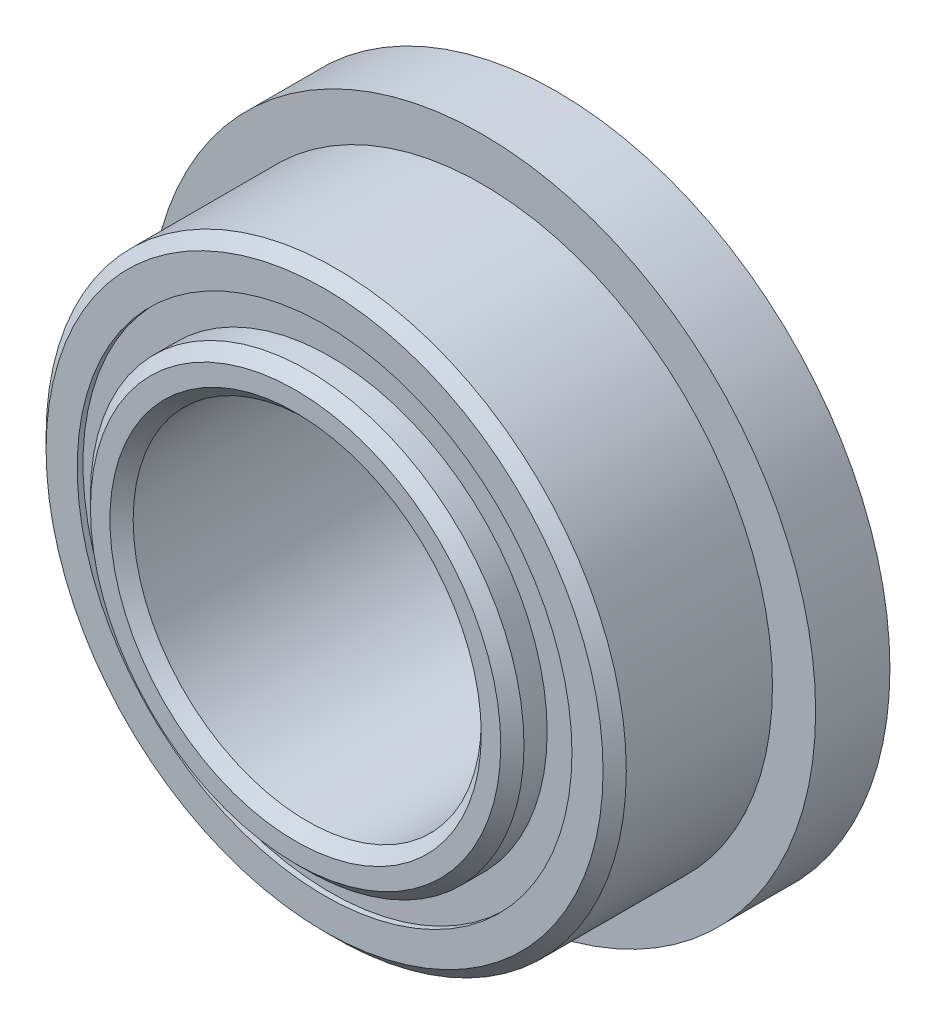
ISO-10303-21;
HEADER;
FILE_DESCRIPTION(('STEP AP214'),'2;1');
FILE_NAME('part.step','',(''),(''),'','','');
FILE_SCHEMA(('AUTOMOTIVE_DESIGN { 1 0 10303 214 1 1 1 1 }'));
ENDSEC;
DATA;
#1=APPLICATION_CONTEXT('core data for automotive mechanical design processes');
#2=APPLICATION_PROTOCOL_DEFINITION('international standard','automotive_design',2000,#1);
#3=PRODUCT_CONTEXT('',#1,'mechanical');
#4=PRODUCT('Part','Part','',(#3));
#5=PRODUCT_RELATED_PRODUCT_CATEGORY('part','',(#4));
#6=PRODUCT_DEFINITION_FORMATION('','',#4);
#7=PRODUCT_DEFINITION_CONTEXT('part definition',#1,'design');
#8=PRODUCT_DEFINITION('design','',#6,#7);
#9=PRODUCT_DEFINITION_SHAPE('','',#8);
#10=(LENGTH_UNIT() NAMED_UNIT(*) SI_UNIT(.MILLI.,.METRE.));
#11=(NAMED_UNIT(*) PLANE_ANGLE_UNIT() SI_UNIT($,.RADIAN.));
#12=(NAMED_UNIT(*) SI_UNIT($,.STERADIAN.) SOLID_ANGLE_UNIT());
#13=UNCERTAINTY_MEASURE_WITH_UNIT(LENGTH_MEASURE(1.E-05),#10,'distance_accuracy_value','');
#14=(GEOMETRIC_REPRESENTATION_CONTEXT(3) GLOBAL_UNCERTAINTY_ASSIGNED_CONTEXT((#13)) GLOBAL_UNIT_ASSIGNED_CONTEXT((#10,
#11,#12)) REPRESENTATION_CONTEXT('',''));
#15=CARTESIAN_POINT('',(0.,0.,0.));
#16=DIRECTION('',(0.,0.,1.));
#17=DIRECTION('',(1.,0.,0.));
#18=AXIS2_PLACEMENT_3D('',#15,#16,#17);
#19=CARTESIAN_POINT('',(0.,3.38434065934066,-1.508125));
#20=DIRECTION('',(0.,0.,1.));
#21=DIRECTION('',(1.,0.,0.));
#22=AXIS2_PLACEMENT_3D('',#19,#20,#21);
#23=PLANE('',#22);
#24=CARTESIAN_POINT('',(0.,0.,-1.508125));
#25=DIRECTION('',(0.,0.,1.));
#26=DIRECTION('',(1.,0.,0.));
#27=AXIS2_PLACEMENT_3D('',#24,#25,#26);
#28=CIRCLE('',#27,3.38434065934066);
#29=CARTESIAN_POINT('',(3.38434065934066,0.,-1.508125));
#30=VERTEX_POINT('',#29);
#31=EDGE_CURVE('E55',#30,#30,#28,.T.);
#32=ORIENTED_EDGE('',*,*,#31,.F.);
#33=EDGE_LOOP('',(#32));
#34=FACE_BOUND('',#33,.T.);
#35=CARTESIAN_POINT('',(0.,0.,-1.508125));
#36=DIRECTION('',(0.,0.,1.));
#37=DIRECTION('',(1.,0.,0.));
#38=AXIS2_PLACEMENT_3D('',#35,#36,#37);
#39=CIRCLE('',#38,2.96565934065934);
#40=CARTESIAN_POINT('',(2.96565934065934,0.,-1.508125));
#41=VERTEX_POINT('',#40);
#42=EDGE_CURVE('E11',#41,#41,#39,.T.);
#43=ORIENTED_EDGE('',*,*,#42,.T.);
#44=EDGE_LOOP('',(#43));
#45=FACE_BOUND('',#44,.T.);
#46=ADVANCED_FACE('F41',(#34,#45),#23,.F.);
#47=CARTESIAN_POINT('',(0.,0.,1.5875));
#48=DIRECTION('',(0.,0.,1.));
#49=DIRECTION('',(1.,0.,0.));
#50=AXIS2_PLACEMENT_3D('',#47,#48,#49);
#51=CYLINDRICAL_SURFACE('',#50,2.96565934065934);
#52=ORIENTED_EDGE('',*,*,#42,.F.);
#53=EDGE_LOOP('',(#52));
#54=FACE_BOUND('',#53,.T.);
#55=CARTESIAN_POINT('',(0.,0.,-0.735956624828183));
#56=DIRECTION('',(0.,0.,1.));
#57=DIRECTION('',(1.,0.,0.));
#58=AXIS2_PLACEMENT_3D('',#55,#56,#57);
#59=CIRCLE('',#58,2.96565934065934);
#60=CARTESIAN_POINT('',(2.96565934065934,0.,-0.735956624828183));
#61=VERTEX_POINT('',#60);
#62=EDGE_CURVE('E47',#61,#61,#59,.T.);
#63=ORIENTED_EDGE('',*,*,#62,.T.);
#64=EDGE_LOOP('',(#63));
#65=FACE_BOUND('',#64,.T.);
#66=ADVANCED_FACE('F64',(#54,#65),#51,.F.);
#67=CARTESIAN_POINT('',(0.,3.38434065934066,-0.735956624828183));
#68=DIRECTION('',(0.,0.,-1.));
#69=DIRECTION('',(-1.,0.,0.));
#70=AXIS2_PLACEMENT_3D('',#67,#68,#69);
#71=PLANE('',#70);
#72=ORIENTED_EDGE('',*,*,#62,.F.);
#73=EDGE_LOOP('',(#72));
#74=FACE_BOUND('',#73,.T.);
#75=CARTESIAN_POINT('',(0.,0.,-0.735956624828183));
#76=DIRECTION('',(0.,0.,1.));
#77=DIRECTION('',(1.,0.,0.));
#78=AXIS2_PLACEMENT_3D('',#75,#76,#77);
#79=CIRCLE('',#78,3.38434065934066);
#80=CARTESIAN_POINT('',(3.38434065934066,0.,-0.735956624828183));
#81=VERTEX_POINT('',#80);
#82=EDGE_CURVE('E51',#81,#81,#79,.T.);
#83=ORIENTED_EDGE('',*,*,#82,.T.);
#84=EDGE_LOOP('',(#83));
#85=FACE_BOUND('',#84,.T.);
#86=ADVANCED_FACE('F68',(#74,#85),#71,.F.);
#87=CARTESIAN_POINT('',(0.,0.,1.5875));
#88=DIRECTION('',(0.,0.,1.));
#89=DIRECTION('',(1.,0.,0.));
#90=AXIS2_PLACEMENT_3D('',#87,#88,#89);
#91=CYLINDRICAL_SURFACE('',#90,3.38434065934066);
#92=ORIENTED_EDGE('',*,*,#82,.F.);
#93=EDGE_LOOP('',(#92));
#94=FACE_BOUND('',#93,.T.);
#95=ORIENTED_EDGE('',*,*,#31,.T.);
#96=EDGE_LOOP('',(#95));
#97=FACE_BOUND('',#96,.T.);
#98=ADVANCED_FACE('F61',(#94,#97),#91,.T.);
#99=CLOSED_SHELL('',(#46,#66,#86,#98));
#100=MANIFOLD_SOLID_BREP('B2',#99);
#101=CARTESIAN_POINT('',(0.,3.38434065934066,1.508125));
#102=DIRECTION('',(0.,0.,-1.));
#103=DIRECTION('',(-1.,0.,0.));
#104=AXIS2_PLACEMENT_3D('',#101,#102,#103);
#105=PLANE('',#104);
#106=CARTESIAN_POINT('',(0.,0.,1.508125));
#107=DIRECTION('',(0.,0.,1.));
#108=DIRECTION('',(1.,0.,0.));
#109=AXIS2_PLACEMENT_3D('',#106,#107,#108);
#110=CIRCLE('',#109,2.96565934065934);
#111=CARTESIAN_POINT('',(2.96565934065934,0.,1.508125));
#112=VERTEX_POINT('',#111);
#113=EDGE_CURVE('E40',#112,#112,#110,.T.);
#114=ORIENTED_EDGE('',*,*,#113,.F.);
#115=EDGE_LOOP('',(#114));
#116=FACE_BOUND('',#115,.T.);
#117=CARTESIAN_POINT('',(0.,0.,1.508125));
#118=DIRECTION('',(0.,0.,1.));
#119=DIRECTION('',(1.,0.,0.));
#120=AXIS2_PLACEMENT_3D('',#117,#118,#119);
#121=CIRCLE('',#120,3.38434065934066);
#122=CARTESIAN_POINT('',(3.38434065934066,0.,1.508125));
#123=VERTEX_POINT('',#122);
#124=EDGE_CURVE('E122',#123,#123,#121,.T.);
#125=ORIENTED_EDGE('',*,*,#124,.T.);
#126=EDGE_LOOP('',(#125));
#127=FACE_BOUND('',#126,.T.);
#128=ADVANCED_FACE('F108',(#116,#127),#105,.F.);
#129=CARTESIAN_POINT('',(0.,0.,1.5875));
#130=DIRECTION('',(0.,0.,1.));
#131=DIRECTION('',(1.,0.,0.));
#132=AXIS2_PLACEMENT_3D('',#129,#130,#131);
#133=CYLINDRICAL_SURFACE('',#132,2.96565934065934);
#134=CARTESIAN_POINT('',(0.,0.,0.735956624828182));
#135=DIRECTION('',(0.,0.,1.));
#136=DIRECTION('',(1.,0.,0.));
#137=AXIS2_PLACEMENT_3D('',#134,#135,#136);
#138=CIRCLE('',#137,2.96565934065934);
#139=CARTESIAN_POINT('',(2.96565934065934,0.,0.735956624828182));
#140=VERTEX_POINT('',#139);
#141=EDGE_CURVE('E114',#140,#140,#138,.T.);
#142=ORIENTED_EDGE('',*,*,#141,.F.);
#143=EDGE_LOOP('',(#142));
#144=FACE_BOUND('',#143,.T.);
#145=ORIENTED_EDGE('',*,*,#113,.T.);
#146=EDGE_LOOP('',(#145));
#147=FACE_BOUND('',#146,.T.);
#148=ADVANCED_FACE('F137',(#144,#147),#133,.F.);
#149=CARTESIAN_POINT('',(0.,3.38434065934066,0.735956624828182));
#150=DIRECTION('',(0.,0.,1.));
#151=DIRECTION('',(1.,0.,0.));
#152=AXIS2_PLACEMENT_3D('',#149,#150,#151);
#153=PLANE('',#152);
#154=CARTESIAN_POINT('',(0.,0.,0.735956624828182));
#155=DIRECTION('',(0.,0.,1.));
#156=DIRECTION('',(1.,0.,0.));
#157=AXIS2_PLACEMENT_3D('',#154,#155,#156);
#158=CIRCLE('',#157,3.38434065934066);
#159=CARTESIAN_POINT('',(3.38434065934066,0.,0.735956624828182));
#160=VERTEX_POINT('',#159);
#161=EDGE_CURVE('E118',#160,#160,#158,.T.);
#162=ORIENTED_EDGE('',*,*,#161,.F.);
#163=EDGE_LOOP('',(#162));
#164=FACE_BOUND('',#163,.T.);
#165=ORIENTED_EDGE('',*,*,#141,.T.);
#166=EDGE_LOOP('',(#165));
#167=FACE_BOUND('',#166,.T.);
#168=ADVANCED_FACE('F132',(#164,#167),#153,.F.);
#169=CARTESIAN_POINT('',(0.,0.,1.5875));
#170=DIRECTION('',(0.,0.,1.));
#171=DIRECTION('',(1.,0.,0.));
#172=AXIS2_PLACEMENT_3D('',#169,#170,#171);
#173=CYLINDRICAL_SURFACE('',#172,3.38434065934066);
#174=ORIENTED_EDGE('',*,*,#124,.F.);
#175=EDGE_LOOP('',(#174));
#176=FACE_BOUND('',#175,.T.);
#177=ORIENTED_EDGE('',*,*,#161,.T.);
#178=EDGE_LOOP('',(#177));
#179=FACE_BOUND('',#178,.T.);
#180=ADVANCED_FACE('F129',(#176,#179),#173,.T.);
#181=CLOSED_SHELL('',(#128,#148,#168,#180));
#182=MANIFOLD_SOLID_BREP('B6',#181);
#183=CARTESIAN_POINT('',(-1.86621817602857,2.56862895714048,0.));
#184=DIRECTION('',(0.,0.,1.));
#185=DIRECTION('',(0.587785252292462,-0.809016994374955,0.));
#186=AXIS2_PLACEMENT_3D('',#183,#184,#185);
#187=SPHERICAL_SURFACE('',#186,0.735956624828183);
#188=CARTESIAN_POINT('',(-1.86621817602857,2.56862895714048,0.735956624828182));
#189=VERTEX_POINT('',#188);
#190=VERTEX_LOOP('',#189);
#191=FACE_BOUND('',#190,.T.);
#192=ADVANCED_FACE('F175',(#191),#187,.T.);
#193=CLOSED_SHELL('',(#192));
#194=MANIFOLD_SOLID_BREP('B35',#193);
#195=CARTESIAN_POINT('',(-3.0196044392371,0.981128957140492,0.));
#196=DIRECTION('',(0.,0.,1.));
#197=DIRECTION('',(0.95105651629515,-0.309016994374958,0.));
#198=AXIS2_PLACEMENT_3D('',#195,#196,#197);
#199=SPHERICAL_SURFACE('',#198,0.735956624828183);
#200=CARTESIAN_POINT('',(-3.0196044392371,0.981128957140492,0.735956624828182));
#201=VERTEX_POINT('',#200);
#202=VERTEX_LOOP('',#201);
#203=FACE_BOUND('',#202,.T.);
#204=ADVANCED_FACE('F195',(#203),#199,.T.);
#205=CLOSED_SHELL('',(#204));
#206=MANIFOLD_SOLID_BREP('B104',#205);
#207=CARTESIAN_POINT('',(-3.01960443923712,-0.981128957140429,0.));
#208=DIRECTION('',(0.,0.,1.));
#209=DIRECTION('',(0.951056516295157,0.309016994374938,0.));
#210=AXIS2_PLACEMENT_3D('',#207,#208,#209);
#211=SPHERICAL_SURFACE('',#210,0.735956624828183);
#212=CARTESIAN_POINT('',(-3.01960443923712,-0.981128957140429,0.735956624828182));
#213=VERTEX_POINT('',#212);
#214=VERTEX_LOOP('',#213);
#215=FACE_BOUND('',#214,.T.);
#216=ADVANCED_FACE('F215',(#215),#211,.T.);
#217=CLOSED_SHELL('',(#216));
#218=MANIFOLD_SOLID_BREP('B171',#217);
#219=CARTESIAN_POINT('',(-1.86621817602862,-2.56862895714044,0.));
#220=DIRECTION('',(0.,0.,1.));
#221=DIRECTION('',(0.58778525229248,0.809016994374942,0.));
#222=AXIS2_PLACEMENT_3D('',#219,#220,#221);
#223=SPHERICAL_SURFACE('',#222,0.735956624828183);
#224=CARTESIAN_POINT('',(-1.86621817602862,-2.56862895714044,0.735956624828182));
#225=VERTEX_POINT('',#224);
#226=VERTEX_LOOP('',#225);
#227=FACE_BOUND('',#226,.T.);
#228=ADVANCED_FACE('F235',(#227),#223,.T.);
#229=CLOSED_SHELL('',(#228));
#230=MANIFOLD_SOLID_BREP('B191',#229);
#231=CARTESIAN_POINT('',(0.,-3.175,0.));
#232=DIRECTION('',(0.,0.,1.));
#233=DIRECTION('',(0.,1.,0.));
#234=AXIS2_PLACEMENT_3D('',#231,#232,#233);
#235=SPHERICAL_SURFACE('',#234,0.735956624828183);
#236=CARTESIAN_POINT('',(0.,-3.175,0.735956624828182));
#237=VERTEX_POINT('',#236);
#238=VERTEX_LOOP('',#237);
#239=FACE_BOUND('',#238,.T.);
#240=ADVANCED_FACE('F255',(#239),#235,.T.);
#241=CLOSED_SHELL('',(#240));
#242=MANIFOLD_SOLID_BREP('B211',#241);
#243=CARTESIAN_POINT('',(1.86621817602859,-2.56862895714047,0.));
#244=DIRECTION('',(0.,0.,1.));
#245=DIRECTION('',(-0.587785252292469,0.809016994374951,0.));
#246=AXIS2_PLACEMENT_3D('',#243,#244,#245);
#247=SPHERICAL_SURFACE('',#246,0.735956624828183);
#248=CARTESIAN_POINT('',(1.86621817602859,-2.56862895714047,0.735956624828182));
#249=VERTEX_POINT('',#248);
#250=VERTEX_LOOP('',#249);
#251=FACE_BOUND('',#250,.T.);
#252=ADVANCED_FACE('F275',(#251),#247,.T.);
#253=CLOSED_SHELL('',(#252));
#254=MANIFOLD_SOLID_BREP('B231',#253);
#255=CARTESIAN_POINT('',(3.01960443923711,-0.981128957140471,0.));
#256=DIRECTION('',(0.,0.,1.));
#257=DIRECTION('',(-0.951056516295152,0.309016994374952,0.));
#258=AXIS2_PLACEMENT_3D('',#255,#256,#257);
#259=SPHERICAL_SURFACE('',#258,0.735956624828183);
#260=CARTESIAN_POINT('',(3.01960443923711,-0.981128957140471,0.735956624828182));
#261=VERTEX_POINT('',#260);
#262=VERTEX_LOOP('',#261);
#263=FACE_BOUND('',#262,.T.);
#264=ADVANCED_FACE('F295',(#263),#259,.T.);
#265=CLOSED_SHELL('',(#264));
#266=MANIFOLD_SOLID_BREP('B251',#265);
#267=CARTESIAN_POINT('',(3.01960443923712,0.98112895714045,0.));
#268=DIRECTION('',(0.,0.,1.));
#269=DIRECTION('',(-0.951056516295155,-0.309016994374945,0.));
#270=AXIS2_PLACEMENT_3D('',#267,#268,#269);
#271=SPHERICAL_SURFACE('',#270,0.735956624828183);
#272=CARTESIAN_POINT('',(3.01960443923712,0.98112895714045,0.735956624828182));
#273=VERTEX_POINT('',#272);
#274=VERTEX_LOOP('',#273);
#275=FACE_BOUND('',#274,.T.);
#276=ADVANCED_FACE('F315',(#275),#271,.T.);
#277=CLOSED_SHELL('',(#276));
#278=MANIFOLD_SOLID_BREP('B271',#277);
#279=CARTESIAN_POINT('',(1.86621817602861,2.56862895714046,0.));
#280=DIRECTION('',(0.,0.,1.));
#281=DIRECTION('',(-0.587785252292474,-0.809016994374947,0.));
#282=AXIS2_PLACEMENT_3D('',#279,#280,#281);
#283=SPHERICAL_SURFACE('',#282,0.735956624828183);
#284=CARTESIAN_POINT('',(1.86621817602861,2.56862895714046,0.735956624828182));
#285=VERTEX_POINT('',#284);
#286=VERTEX_LOOP('',#285);
#287=FACE_BOUND('',#286,.T.);
#288=ADVANCED_FACE('F335',(#287),#283,.T.);
#289=CLOSED_SHELL('',(#288));
#290=MANIFOLD_SOLID_BREP('B291',#289);
#291=CARTESIAN_POINT('',(0.,3.175,0.));
#292=DIRECTION('',(0.,0.,1.));
#293=DIRECTION('',(0.,-1.,0.));
#294=AXIS2_PLACEMENT_3D('',#291,#292,#293);
#295=SPHERICAL_SURFACE('',#294,0.735956624828183);
#296=CARTESIAN_POINT('',(0.,3.175,0.735956624828182));
#297=VERTEX_POINT('',#296);
#298=VERTEX_LOOP('',#297);
#299=FACE_BOUND('',#298,.T.);
#300=ADVANCED_FACE('F357',(#299),#295,.T.);
#301=CLOSED_SHELL('',(#300));
#302=MANIFOLD_SOLID_BREP('B311',#301);
#303=CARTESIAN_POINT('',(0.,0.,1.82499));
#304=DIRECTION('',(0.,0.,-1.));
#305=DIRECTION('',(-1.,0.,0.));
#306=AXIS2_PLACEMENT_3D('',#303,#304,#305);
#307=CONICAL_SURFACE('',#306,2.96565934065934,0.785398163397446);
#308=CARTESIAN_POINT('',(0.,0.,1.98374));
#309=DIRECTION('',(0.,0.,1.));
#310=DIRECTION('',(1.,0.,0.));
#311=AXIS2_PLACEMENT_3D('',#308,#309,#310);
#312=CIRCLE('',#311,2.80690934065934);
#313=CARTESIAN_POINT('',(2.80690934065934,0.,1.98374));
#314=VERTEX_POINT('',#313);
#315=EDGE_CURVE('E410',#314,#314,#312,.T.);
#316=ORIENTED_EDGE('',*,*,#315,.F.);
#317=EDGE_LOOP('',(#316));
#318=FACE_BOUND('',#317,.T.);
#319=CARTESIAN_POINT('',(0.,0.,1.82499));
#320=DIRECTION('',(0.,0.,1.));
#321=DIRECTION('',(1.,0.,0.));
#322=AXIS2_PLACEMENT_3D('',#319,#320,#321);
#323=CIRCLE('',#322,2.96565934065934);
#324=CARTESIAN_POINT('',(2.96565934065934,0.,1.82499));
#325=VERTEX_POINT('',#324);
#326=EDGE_CURVE('E356',#325,#325,#323,.T.);
#327=ORIENTED_EDGE('',*,*,#326,.T.);
#328=EDGE_LOOP('',(#327));
#329=FACE_BOUND('',#328,.T.);
#330=ADVANCED_FACE('F376',(#318,#329),#307,.T.);
#331=CARTESIAN_POINT('',(0.,0.,1.5875));
#332=DIRECTION('',(0.,0.,1.));
#333=DIRECTION('',(1.,0.,0.));
#334=AXIS2_PLACEMENT_3D('',#331,#332,#333);
#335=CYLINDRICAL_SURFACE('',#334,2.96565934065934);
#336=ORIENTED_EDGE('',*,*,#326,.F.);
#337=EDGE_LOOP('',(#336));
#338=FACE_BOUND('',#337,.T.);
#339=CARTESIAN_POINT('',(0.,0.,0.705555555555554));
#340=DIRECTION('',(0.,0.,1.));
#341=DIRECTION('',(1.,0.,0.));
#342=AXIS2_PLACEMENT_3D('',#339,#340,#341);
#343=CIRCLE('',#342,2.96565934065934);
#344=CARTESIAN_POINT('',(2.96565934065934,0.,0.705555555555554));
#345=VERTEX_POINT('',#344);
#346=EDGE_CURVE('E382',#345,#345,#343,.T.);
#347=ORIENTED_EDGE('',*,*,#346,.T.);
#348=EDGE_LOOP('',(#347));
#349=FACE_BOUND('',#348,.T.);
#350=ADVANCED_FACE('F417',(#338,#349),#335,.T.);
#351=CARTESIAN_POINT('',(0.,0.,0.));
#352=DIRECTION('',(0.,0.,1.));
#353=DIRECTION('',(1.,0.,0.));
#354=AXIS2_PLACEMENT_3D('',#351,#352,#353);
#355=TOROIDAL_SURFACE('',#354,3.175,0.735956624828181);
#356=ORIENTED_EDGE('',*,*,#346,.F.);
#357=EDGE_LOOP('',(#356));
#358=FACE_BOUND('',#357,.T.);
#359=CARTESIAN_POINT('',(0.,0.,-0.705555555555556));
#360=DIRECTION('',(0.,0.,1.));
#361=DIRECTION('',(1.,0.,0.));
#362=AXIS2_PLACEMENT_3D('',#359,#360,#361);
#363=CIRCLE('',#362,2.96565934065934);
#364=CARTESIAN_POINT('',(2.96565934065934,0.,-0.705555555555556));
#365=VERTEX_POINT('',#364);
#366=EDGE_CURVE('E386',#365,#365,#363,.T.);
#367=ORIENTED_EDGE('',*,*,#366,.T.);
#368=EDGE_LOOP('',(#367));
#369=FACE_BOUND('',#368,.T.);
#370=ADVANCED_FACE('F421',(#358,#369),#355,.F.);
#371=CARTESIAN_POINT('',(0.,0.,1.5875));
#372=DIRECTION('',(0.,0.,1.));
#373=DIRECTION('',(1.,0.,0.));
#374=AXIS2_PLACEMENT_3D('',#371,#372,#373);
#375=CYLINDRICAL_SURFACE('',#374,2.96565934065934);
#376=ORIENTED_EDGE('',*,*,#366,.F.);
#377=EDGE_LOOP('',(#376));
#378=FACE_BOUND('',#377,.T.);
#379=CARTESIAN_POINT('',(0.,0.,-1.82499));
#380=DIRECTION('',(0.,0.,1.));
#381=DIRECTION('',(1.,0.,0.));
#382=AXIS2_PLACEMENT_3D('',#379,#380,#381);
#383=CIRCLE('',#382,2.96565934065934);
#384=CARTESIAN_POINT('',(2.96565934065934,0.,-1.82499));
#385=VERTEX_POINT('',#384);
#386=EDGE_CURVE('E390',#385,#385,#383,.T.);
#387=ORIENTED_EDGE('',*,*,#386,.T.);
#388=EDGE_LOOP('',(#387));
#389=FACE_BOUND('',#388,.T.);
#390=ADVANCED_FACE('F426',(#378,#389),#375,.T.);
#391=CARTESIAN_POINT('',(0.,0.,-1.98374));
#392=DIRECTION('',(0.,0.,1.));
#393=DIRECTION('',(1.,0.,0.));
#394=AXIS2_PLACEMENT_3D('',#391,#392,#393);
#395=CONICAL_SURFACE('',#394,2.80690934065934,0.785398163397446);
#396=ORIENTED_EDGE('',*,*,#386,.F.);
#397=EDGE_LOOP('',(#396));
#398=FACE_BOUND('',#397,.T.);
#399=CARTESIAN_POINT('',(0.,0.,-1.98374));
#400=DIRECTION('',(0.,0.,1.));
#401=DIRECTION('',(1.,0.,0.));
#402=AXIS2_PLACEMENT_3D('',#399,#400,#401);
#403=CIRCLE('',#402,2.80690934065934);
#404=CARTESIAN_POINT('',(2.80690934065934,0.,-1.98374));
#405=VERTEX_POINT('',#404);
#406=EDGE_CURVE('E395',#405,#405,#403,.T.);
#407=ORIENTED_EDGE('',*,*,#406,.T.);
#408=EDGE_LOOP('',(#407));
#409=FACE_BOUND('',#408,.T.);
#410=ADVANCED_FACE('F432',(#398,#409),#395,.T.);
#411=CARTESIAN_POINT('',(0.,2.80690934065934,-1.98374));
#412=DIRECTION('',(0.,0.,1.));
#413=DIRECTION('',(1.,0.,0.));
#414=AXIS2_PLACEMENT_3D('',#411,#412,#413);
#415=PLANE('',#414);
#416=ORIENTED_EDGE('',*,*,#406,.F.);
#417=EDGE_LOOP('',(#416));
#418=FACE_BOUND('',#417,.T.);
#419=CARTESIAN_POINT('',(0.,0.,-1.98374));
#420=DIRECTION('',(0.,0.,1.));
#421=DIRECTION('',(1.,0.,0.));
#422=AXIS2_PLACEMENT_3D('',#419,#420,#421);
#423=CIRCLE('',#422,2.54);
#424=CARTESIAN_POINT('',(2.54,0.,-1.98374));
#425=VERTEX_POINT('',#424);
#426=EDGE_CURVE('E398',#425,#425,#423,.T.);
#427=ORIENTED_EDGE('',*,*,#426,.T.);
#428=EDGE_LOOP('',(#427));
#429=FACE_BOUND('',#428,.T.);
#430=ADVANCED_FACE('F436',(#418,#429),#415,.F.);
#431=CARTESIAN_POINT('',(0.,0.,-1.82499));
#432=DIRECTION('',(0.,0.,-1.));
#433=DIRECTION('',(-1.,0.,0.));
#434=AXIS2_PLACEMENT_3D('',#431,#432,#433);
#435=CONICAL_SURFACE('',#434,2.38125,0.785398163397446);
#436=ORIENTED_EDGE('',*,*,#426,.F.);
#437=EDGE_LOOP('',(#436));
#438=FACE_BOUND('',#437,.T.);
#439=CARTESIAN_POINT('',(0.,0.,-1.82499));
#440=DIRECTION('',(0.,0.,1.));
#441=DIRECTION('',(1.,0.,0.));
#442=AXIS2_PLACEMENT_3D('',#439,#440,#441);
#443=CIRCLE('',#442,2.38125);
#444=CARTESIAN_POINT('',(2.38125,0.,-1.82499));
#445=VERTEX_POINT('',#444);
#446=EDGE_CURVE('E401',#445,#445,#443,.T.);
#447=ORIENTED_EDGE('',*,*,#446,.T.);
#448=EDGE_LOOP('',(#447));
#449=FACE_BOUND('',#448,.T.);
#450=ADVANCED_FACE('F440',(#438,#449),#435,.F.);
#451=CARTESIAN_POINT('',(0.,0.,1.5875));
#452=DIRECTION('',(0.,0.,1.));
#453=DIRECTION('',(1.,0.,0.));
#454=AXIS2_PLACEMENT_3D('',#451,#452,#453);
#455=CYLINDRICAL_SURFACE('',#454,2.38125);
#456=ORIENTED_EDGE('',*,*,#446,.F.);
#457=EDGE_LOOP('',(#456));
#458=FACE_BOUND('',#457,.T.);
#459=CARTESIAN_POINT('',(0.,0.,1.82499));
#460=DIRECTION('',(0.,0.,1.));
#461=DIRECTION('',(1.,0.,0.));
#462=AXIS2_PLACEMENT_3D('',#459,#460,#461);
#463=CIRCLE('',#462,2.38125);
#464=CARTESIAN_POINT('',(2.38125,0.,1.82499));
#465=VERTEX_POINT('',#464);
#466=EDGE_CURVE('E404',#465,#465,#463,.T.);
#467=ORIENTED_EDGE('',*,*,#466,.T.);
#468=EDGE_LOOP('',(#467));
#469=FACE_BOUND('',#468,.T.);
#470=ADVANCED_FACE('F444',(#458,#469),#455,.F.);
#471=CARTESIAN_POINT('',(0.,0.,1.98374));
#472=DIRECTION('',(0.,0.,1.));
#473=DIRECTION('',(1.,0.,0.));
#474=AXIS2_PLACEMENT_3D('',#471,#472,#473);
#475=CONICAL_SURFACE('',#474,2.54,0.78539816339745);
#476=ORIENTED_EDGE('',*,*,#466,.F.);
#477=EDGE_LOOP('',(#476));
#478=FACE_BOUND('',#477,.T.);
#479=CARTESIAN_POINT('',(0.,0.,1.98374));
#480=DIRECTION('',(0.,0.,1.));
#481=DIRECTION('',(1.,0.,0.));
#482=AXIS2_PLACEMENT_3D('',#479,#480,#481);
#483=CIRCLE('',#482,2.54);
#484=CARTESIAN_POINT('',(2.54,0.,1.98374));
#485=VERTEX_POINT('',#484);
#486=EDGE_CURVE('E407',#485,#485,#483,.T.);
#487=ORIENTED_EDGE('',*,*,#486,.T.);
#488=EDGE_LOOP('',(#487));
#489=FACE_BOUND('',#488,.T.);
#490=ADVANCED_FACE('F448',(#478,#489),#475,.F.);
#491=CARTESIAN_POINT('',(0.,2.54,1.98374));
#492=DIRECTION('',(0.,0.,-1.));
#493=DIRECTION('',(-1.,0.,0.));
#494=AXIS2_PLACEMENT_3D('',#491,#492,#493);
#495=PLANE('',#494);
#496=ORIENTED_EDGE('',*,*,#486,.F.);
#497=EDGE_LOOP('',(#496));
#498=FACE_BOUND('',#497,.T.);
#499=ORIENTED_EDGE('',*,*,#315,.T.);
#500=EDGE_LOOP('',(#499));
#501=FACE_BOUND('',#500,.T.);
#502=ADVANCED_FACE('F414',(#498,#501),#495,.F.);
#503=CLOSED_SHELL('',(#330,#350,#370,#390,#410,#430,#450,#470,#490,#502));
#504=MANIFOLD_SOLID_BREP('B331',#503);
#505=CARTESIAN_POINT('',(0.,0.,1.42875));
#506=DIRECTION('',(0.,0.,-1.));
#507=DIRECTION('',(-1.,0.,0.));
#508=AXIS2_PLACEMENT_3D('',#505,#506,#507);
#509=CONICAL_SURFACE('',#508,3.96875,0.785398163397448);
#510=CARTESIAN_POINT('',(0.,0.,1.5875));
#511=DIRECTION('',(0.,0.,1.));
#512=DIRECTION('',(1.,0.,0.));
#513=AXIS2_PLACEMENT_3D('',#510,#511,#512);
#514=CIRCLE('',#513,3.81);
#515=CARTESIAN_POINT('',(3.81,0.,1.5875));
#516=VERTEX_POINT('',#515);
#517=EDGE_CURVE('E546',#516,#516,#514,.T.);
#518=ORIENTED_EDGE('',*,*,#517,.F.);
#519=EDGE_LOOP('',(#518));
#520=FACE_BOUND('',#519,.T.);
#521=CARTESIAN_POINT('',(0.,0.,1.42875));
#522=DIRECTION('',(0.,0.,1.));
#523=DIRECTION('',(1.,0.,0.));
#524=AXIS2_PLACEMENT_3D('',#521,#522,#523);
#525=CIRCLE('',#524,3.96875);
#526=CARTESIAN_POINT('',(3.96875,0.,1.42875));
#527=VERTEX_POINT('',#526);
#528=EDGE_CURVE('E375',#527,#527,#525,.T.);
#529=ORIENTED_EDGE('',*,*,#528,.T.);
#530=EDGE_LOOP('',(#529));
#531=FACE_BOUND('',#530,.T.);
#532=ADVANCED_FACE('F527',(#520,#531),#509,.T.);
#533=CARTESIAN_POINT('',(0.,0.,1.5875));
#534=DIRECTION('',(0.,0.,1.));
#535=DIRECTION('',(1.,0.,0.));
#536=AXIS2_PLACEMENT_3D('',#533,#534,#535);
#537=CYLINDRICAL_SURFACE('',#536,3.96875);
#538=CARTESIAN_POINT('',(0.,0.,-0.5715));
#539=DIRECTION('',(0.,0.,1.));
#540=DIRECTION('',(1.,0.,0.));
#541=AXIS2_PLACEMENT_3D('',#538,#539,#540);
#542=CIRCLE('',#541,3.96875);
#543=CARTESIAN_POINT('',(3.96875,0.,-0.5715));
#544=VERTEX_POINT('',#543);
#545=EDGE_CURVE('E549',#544,#544,#542,.T.);
#546=ORIENTED_EDGE('',*,*,#545,.T.);
#547=EDGE_LOOP('',(#546));
#548=FACE_BOUND('',#547,.T.);
#549=ORIENTED_EDGE('',*,*,#528,.F.);
#550=EDGE_LOOP('',(#549));
#551=FACE_BOUND('',#550,.T.);
#552=ADVANCED_FACE('F583',(#548,#551),#537,.T.);
#553=CARTESIAN_POINT('',(0.,0.,0.));
#554=DIRECTION('',(0.,0.,1.));
#555=DIRECTION('',(1.,0.,0.));
#556=AXIS2_PLACEMENT_3D('',#553,#554,#555);
#557=TOROIDAL_SURFACE('',#556,3.175,0.735956624828183);
#558=CARTESIAN_POINT('',(0.,0.,-0.5715));
#559=DIRECTION('',(0.,0.,1.));
#560=DIRECTION('',(1.,0.,0.));
#561=AXIS2_PLACEMENT_3D('',#558,#559,#560);
#562=CIRCLE('',#561,3.63870238691265);
#563=CARTESIAN_POINT('',(3.63870238691265,0.,-0.5715));
#564=VERTEX_POINT('',#563);
#565=EDGE_CURVE('E530',#564,#564,#562,.F.);
#566=ORIENTED_EDGE('',*,*,#565,.T.);
#567=EDGE_LOOP('',(#566));
#568=FACE_BOUND('',#567,.T.);
#569=CARTESIAN_POINT('',(0.,0.,0.705555555555555));
#570=DIRECTION('',(0.,0.,1.));
#571=DIRECTION('',(1.,0.,0.));
#572=AXIS2_PLACEMENT_3D('',#569,#570,#571);
#573=CIRCLE('',#572,3.38434065934066);
#574=CARTESIAN_POINT('',(3.38434065934066,0.,0.705555555555555));
#575=VERTEX_POINT('',#574);
#576=EDGE_CURVE('E538',#575,#575,#573,.T.);
#577=ORIENTED_EDGE('',*,*,#576,.T.);
#578=EDGE_LOOP('',(#577));
#579=FACE_BOUND('',#578,.T.);
#580=ADVANCED_FACE('F588',(#568,#579),#557,.F.);
#581=CARTESIAN_POINT('',(0.,0.,1.5875));
#582=DIRECTION('',(0.,0.,1.));
#583=DIRECTION('',(1.,0.,0.));
#584=AXIS2_PLACEMENT_3D('',#581,#582,#583);
#585=CYLINDRICAL_SURFACE('',#584,3.38434065934066);
#586=ORIENTED_EDGE('',*,*,#576,.F.);
#587=EDGE_LOOP('',(#586));
#588=FACE_BOUND('',#587,.T.);
#589=CARTESIAN_POINT('',(0.,0.,1.5875));
#590=DIRECTION('',(0.,0.,1.));
#591=DIRECTION('',(1.,0.,0.));
#592=AXIS2_PLACEMENT_3D('',#589,#590,#591);
#593=CIRCLE('',#592,3.38434065934066);
#594=CARTESIAN_POINT('',(3.38434065934066,0.,1.5875));
#595=VERTEX_POINT('',#594);
#596=EDGE_CURVE('E543',#595,#595,#593,.T.);
#597=ORIENTED_EDGE('',*,*,#596,.T.);
#598=EDGE_LOOP('',(#597));
#599=FACE_BOUND('',#598,.T.);
#600=ADVANCED_FACE('F594',(#588,#599),#585,.F.);
#601=CARTESIAN_POINT('',(0.,3.81,1.5875));
#602=DIRECTION('',(0.,0.,-1.));
#603=DIRECTION('',(-1.,0.,0.));
#604=AXIS2_PLACEMENT_3D('',#601,#602,#603);
#605=PLANE('',#604);
#606=ORIENTED_EDGE('',*,*,#596,.F.);
#607=EDGE_LOOP('',(#606));
#608=FACE_BOUND('',#607,.T.);
#609=ORIENTED_EDGE('',*,*,#517,.T.);
#610=EDGE_LOOP('',(#609));
#611=FACE_BOUND('',#610,.T.);
#612=ADVANCED_FACE('F592',(#608,#611),#605,.F.);
#613=CARTESIAN_POINT('',(0.,3.38434065934066,-0.5715));
#614=DIRECTION('',(0.,0.,1.));
#615=DIRECTION('',(1.,0.,0.));
#616=AXIS2_PLACEMENT_3D('',#613,#614,#615);
#617=PLANE('',#616);
#618=CARTESIAN_POINT('',(0.,0.,-0.5715));
#619=DIRECTION('',(0.,0.,-1.));
#620=DIRECTION('',(-1.,0.,0.));
#621=AXIS2_PLACEMENT_3D('',#618,#619,#620);
#622=CIRCLE('',#621,3.38434065934066);
#623=CARTESIAN_POINT('',(-3.38434065934066,0.,-0.5715));
#624=VERTEX_POINT('',#623);
#625=EDGE_CURVE('E558',#624,#624,#622,.T.);
#626=ORIENTED_EDGE('',*,*,#625,.T.);
#627=EDGE_LOOP('',(#626));
#628=FACE_BOUND('',#627,.T.);
#629=ORIENTED_EDGE('',*,*,#565,.F.);
#630=EDGE_LOOP('',(#629));
#631=FACE_BOUND('',#630,.T.);
#632=ADVANCED_FACE('F562',(#628,#631),#617,.T.);
#633=CARTESIAN_POINT('',(0.,0.,-0.5715));
#634=DIRECTION('',(0.,0.,-1.));
#635=DIRECTION('',(-1.,0.,0.));
#636=AXIS2_PLACEMENT_3D('',#633,#634,#635);
#637=CIRCLE('',#636,4.5593);
#638=CARTESIAN_POINT('',(-4.5593,0.,-0.5715));
#639=VERTEX_POINT('',#638);
#640=EDGE_CURVE('E555',#639,#639,#637,.T.);
#641=ORIENTED_EDGE('',*,*,#640,.F.);
#642=EDGE_LOOP('',(#641));
#643=FACE_BOUND('',#642,.T.);
#644=ORIENTED_EDGE('',*,*,#545,.F.);
#645=EDGE_LOOP('',(#644));
#646=FACE_BOUND('',#645,.T.);
#647=ADVANCED_FACE('F577',(#643,#646),#617,.T.);
#648=CARTESIAN_POINT('',(0.,0.,-1.5875));
#649=DIRECTION('',(0.,0.,-1.));
#650=DIRECTION('',(-1.,0.,0.));
#651=AXIS2_PLACEMENT_3D('',#648,#649,#650);
#652=CYLINDRICAL_SURFACE('',#651,4.5593);
#653=ORIENTED_EDGE('',*,*,#640,.T.);
#654=EDGE_LOOP('',(#653));
#655=FACE_BOUND('',#654,.T.);
#656=CARTESIAN_POINT('',(0.,0.,-1.5875));
#657=DIRECTION('',(0.,0.,-1.));
#658=DIRECTION('',(-1.,0.,0.));
#659=AXIS2_PLACEMENT_3D('',#656,#657,#658);
#660=CIRCLE('',#659,4.5593);
#661=CARTESIAN_POINT('',(-4.5593,0.,-1.5875));
#662=VERTEX_POINT('',#661);
#663=EDGE_CURVE('E552',#662,#662,#660,.T.);
#664=ORIENTED_EDGE('',*,*,#663,.F.);
#665=EDGE_LOOP('',(#664));
#666=FACE_BOUND('',#665,.T.);
#667=ADVANCED_FACE('F568',(#655,#666),#652,.T.);
#668=CARTESIAN_POINT('',(0.,0.,1.5875));
#669=DIRECTION('',(0.,0.,1.));
#670=DIRECTION('',(1.,0.,0.));
#671=AXIS2_PLACEMENT_3D('',#668,#669,#670);
#672=CYLINDRICAL_SURFACE('',#671,3.38434065934066);
#673=CARTESIAN_POINT('',(0.,0.,-1.5875));
#674=DIRECTION('',(0.,0.,1.));
#675=DIRECTION('',(1.,0.,0.));
#676=AXIS2_PLACEMENT_3D('',#673,#674,#675);
#677=CIRCLE('',#676,3.38434065934066);
#678=CARTESIAN_POINT('',(3.38434065934066,0.,-1.5875));
#679=VERTEX_POINT('',#678);
#680=EDGE_CURVE('E534',#679,#679,#677,.T.);
#681=ORIENTED_EDGE('',*,*,#680,.F.);
#682=EDGE_LOOP('',(#681));
#683=FACE_BOUND('',#682,.T.);
#684=ORIENTED_EDGE('',*,*,#625,.F.);
#685=EDGE_LOOP('',(#684));
#686=FACE_BOUND('',#685,.T.);
#687=ADVANCED_FACE('F565',(#683,#686),#672,.F.);
#688=CARTESIAN_POINT('',(0.,3.81,-1.5875));
#689=DIRECTION('',(0.,0.,1.));
#690=DIRECTION('',(1.,0.,0.));
#691=AXIS2_PLACEMENT_3D('',#688,#689,#690);
#692=PLANE('',#691);
#693=ORIENTED_EDGE('',*,*,#680,.T.);
#694=EDGE_LOOP('',(#693));
#695=FACE_BOUND('',#694,.T.);
#696=ORIENTED_EDGE('',*,*,#663,.T.);
#697=EDGE_LOOP('',(#696));
#698=FACE_BOUND('',#697,.T.);
#699=ADVANCED_FACE('F567',(#695,#698),#692,.F.);
#700=CLOSED_SHELL('',(#532,#552,#580,#600,#612,#632,#647,#667,#687,#699));
#701=MANIFOLD_SOLID_BREP('B351',#700);
#702=ADVANCED_BREP_SHAPE_REPRESENTATION('',(#18,#100,#182,#194,#206,#218,#230,#242,#254,#266,
#278,#290,#302,#504,#701),#14);
#703=SHAPE_DEFINITION_REPRESENTATION(#9,#702);
ENDSEC;
END-ISO-10303-21;
